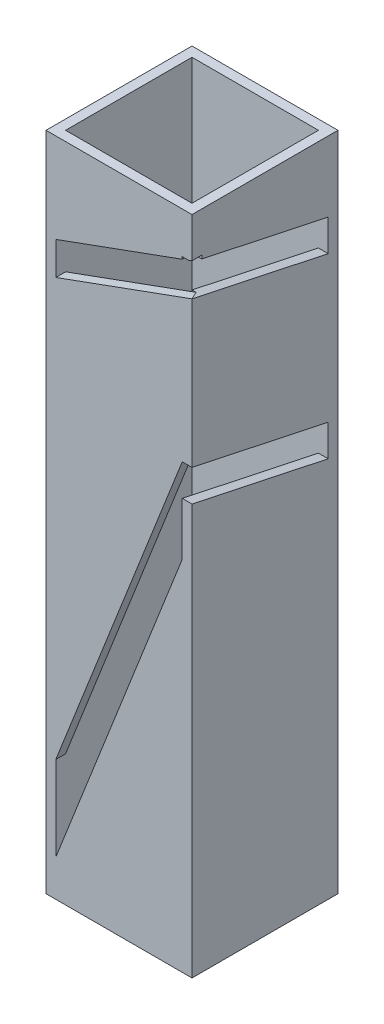
ISO-10303-21;
HEADER;
FILE_DESCRIPTION(('STEP AP214'),'2;1');
FILE_NAME('part.step','',(''),(''),'','','');
FILE_SCHEMA(('AUTOMOTIVE_DESIGN { 1 0 10303 214 1 1 1 1 }'));
ENDSEC;
DATA;
#1=APPLICATION_CONTEXT('core data for automotive mechanical design processes');
#2=APPLICATION_PROTOCOL_DEFINITION('international standard','automotive_design',2000,#1);
#3=PRODUCT_CONTEXT('',#1,'mechanical');
#4=PRODUCT('Part','Part','',(#3));
#5=PRODUCT_RELATED_PRODUCT_CATEGORY('part','',(#4));
#6=PRODUCT_DEFINITION_FORMATION('','',#4);
#7=PRODUCT_DEFINITION_CONTEXT('part definition',#1,'design');
#8=PRODUCT_DEFINITION('design','',#6,#7);
#9=PRODUCT_DEFINITION_SHAPE('','',#8);
#10=(LENGTH_UNIT() NAMED_UNIT(*) SI_UNIT(.MILLI.,.METRE.));
#11=(NAMED_UNIT(*) PLANE_ANGLE_UNIT() SI_UNIT($,.RADIAN.));
#12=(NAMED_UNIT(*) SI_UNIT($,.STERADIAN.) SOLID_ANGLE_UNIT());
#13=UNCERTAINTY_MEASURE_WITH_UNIT(LENGTH_MEASURE(1.E-05),#10,'distance_accuracy_value','');
#14=(GEOMETRIC_REPRESENTATION_CONTEXT(3) GLOBAL_UNCERTAINTY_ASSIGNED_CONTEXT((#13)) GLOBAL_UNIT_ASSIGNED_CONTEXT((#10,
#11,#12)) REPRESENTATION_CONTEXT('',''));
#15=CARTESIAN_POINT('',(0.,0.,0.));
#16=DIRECTION('',(0.,0.,1.));
#17=DIRECTION('',(1.,0.,0.));
#18=AXIS2_PLACEMENT_3D('',#15,#16,#17);
#19=CARTESIAN_POINT('',(19.431,203.2,19.431));
#20=DIRECTION('',(0.,0.,-1.));
#21=DIRECTION('',(-1.,0.,0.));
#22=AXIS2_PLACEMENT_3D('',#19,#20,#21);
#23=PLANE('',#22);
#24=DIRECTION('',(-0.939692620785909,-0.342020143325666,0.));
#25=VECTOR('',#24,1.);
#26=CARTESIAN_POINT('',(-19.431,175.661977169892,19.431));
#27=LINE('',#26,#25);
#28=CARTESIAN_POINT('',(19.431,189.806588413945,19.431));
#29=VERTEX_POINT('',#28);
#30=CARTESIAN_POINT('',(-19.431,175.661977169892,19.431));
#31=VERTEX_POINT('',#30);
#32=EDGE_CURVE('E208',#29,#31,#27,.T.);
#33=ORIENTED_EDGE('',*,*,#32,.T.);
#34=DIRECTION('',(0.,-1.,0.));
#35=VECTOR('',#34,1.);
#36=CARTESIAN_POINT('',(-19.431,203.2,19.431));
#37=LINE('',#36,#35);
#38=CARTESIAN_POINT('',(-19.431,203.2,19.431));
#39=VERTEX_POINT('',#38);
#40=EDGE_CURVE('E222',#39,#31,#37,.T.);
#41=ORIENTED_EDGE('',*,*,#40,.F.);
#42=DIRECTION('',(1.,0.,0.));
#43=VECTOR('',#42,1.);
#44=CARTESIAN_POINT('',(19.431,203.2,19.431));
#45=LINE('',#44,#43);
#46=CARTESIAN_POINT('',(19.431,203.2,19.431));
#47=VERTEX_POINT('',#46);
#48=EDGE_CURVE('E287',#39,#47,#45,.T.);
#49=ORIENTED_EDGE('',*,*,#48,.T.);
#50=DIRECTION('',(0.,-1.,0.));
#51=VECTOR('',#50,1.);
#52=CARTESIAN_POINT('',(19.431,203.2,19.431));
#53=LINE('',#52,#51);
#54=CARTESIAN_POINT('',(19.431,189.86233031499,19.431));
#55=VERTEX_POINT('',#54);
#56=EDGE_CURVE('E242',#47,#55,#53,.T.);
#57=ORIENTED_EDGE('',*,*,#56,.T.);
#58=DIRECTION('',(0.,1.,0.));
#59=VECTOR('',#58,1.);
#60=CARTESIAN_POINT('',(19.431,203.2,19.431));
#61=LINE('',#60,#59);
#62=EDGE_CURVE('E225',#29,#55,#61,.T.);
#63=ORIENTED_EDGE('',*,*,#62,.F.);
#64=EDGE_LOOP('',(#33,#41,#49,#57,#63));
#65=FACE_BOUND('',#64,.T.);
#66=ADVANCED_FACE('F33',(#65),#23,.T.);
#67=DIRECTION('',(0.366501226724284,0.93041756798203,0.));
#68=VECTOR('',#67,1.);
#69=CARTESIAN_POINT('',(19.431,109.909043825111,19.431));
#70=LINE('',#69,#68);
#71=CARTESIAN_POINT('',(-19.431,11.2521093038011,19.431));
#72=VERTEX_POINT('',#71);
#73=CARTESIAN_POINT('',(19.431,109.909043825111,19.431));
#74=VERTEX_POINT('',#73);
#75=EDGE_CURVE('E346',#72,#74,#70,.T.);
#76=ORIENTED_EDGE('',*,*,#75,.T.);
#77=CARTESIAN_POINT('',(19.431,0.,19.431));
#78=VERTEX_POINT('',#77);
#79=EDGE_CURVE('E247',#74,#78,#53,.T.);
#80=ORIENTED_EDGE('',*,*,#79,.T.);
#81=DIRECTION('',(1.,0.,0.));
#82=VECTOR('',#81,1.);
#83=CARTESIAN_POINT('',(19.431,0.,19.431));
#84=LINE('',#83,#82);
#85=CARTESIAN_POINT('',(-19.431,0.,19.431));
#86=VERTEX_POINT('',#85);
#87=EDGE_CURVE('E280',#86,#78,#84,.T.);
#88=ORIENTED_EDGE('',*,*,#87,.F.);
#89=EDGE_CURVE('E235',#72,#86,#37,.T.);
#90=ORIENTED_EDGE('',*,*,#89,.F.);
#91=EDGE_LOOP('',(#76,#80,#88,#90));
#92=FACE_BOUND('',#91,.T.);
#93=ADVANCED_FACE('F467',(#92),#23,.T.);
#94=CARTESIAN_POINT('',(19.431,203.2,19.431));
#95=DIRECTION('',(-1.,0.,0.));
#96=DIRECTION('',(0.,0.,1.));
#97=AXIS2_PLACEMENT_3D('',#94,#95,#96);
#98=PLANE('',#97);
#99=DIRECTION('',(0.,-0.207911690817749,-0.978147600733808));
#100=VECTOR('',#99,1.);
#101=CARTESIAN_POINT('',(19.431,171.864163049281,-19.431));
#102=LINE('',#101,#100);
#103=CARTESIAN_POINT('',(19.431,180.124536148901,19.431));
#104=VERTEX_POINT('',#103);
#105=CARTESIAN_POINT('',(19.431,171.864163049281,-19.431));
#106=VERTEX_POINT('',#105);
#107=EDGE_CURVE('E318',#104,#106,#102,.T.);
#108=ORIENTED_EDGE('',*,*,#107,.T.);
#109=DIRECTION('',(0.,-1.,0.));
#110=VECTOR('',#109,1.);
#111=CARTESIAN_POINT('',(19.431,203.2,-19.431));
#112=LINE('',#111,#110);
#113=CARTESIAN_POINT('',(19.431,127.,-19.431));
#114=VERTEX_POINT('',#113);
#115=EDGE_CURVE('E258',#106,#114,#112,.T.);
#116=ORIENTED_EDGE('',*,*,#115,.T.);
#117=DIRECTION('',(0.,0.207911690817763,0.978147600733805));
#118=VECTOR('',#117,1.);
#119=CARTESIAN_POINT('',(19.431,127.,-19.431));
#120=LINE('',#119,#118);
#121=CARTESIAN_POINT('',(19.431,135.898042784631,22.431));
#122=VERTEX_POINT('',#121);
#123=EDGE_CURVE('E302',#114,#122,#120,.T.);
#124=ORIENTED_EDGE('',*,*,#123,.T.);
#125=DIRECTION('',(0.,0.,1.));
#126=VECTOR('',#125,1.);
#127=CARTESIAN_POINT('',(19.431,135.898042784631,-111.132638802338));
#128=LINE('',#127,#126);
#129=CARTESIAN_POINT('',(19.431,135.898042784631,19.431));
#130=VERTEX_POINT('',#129);
#131=EDGE_CURVE('E350',#130,#122,#128,.T.);
#132=ORIENTED_EDGE('',*,*,#131,.F.);
#133=CARTESIAN_POINT('',(19.431,179.670295131112,19.431));
#134=VERTEX_POINT('',#133);
#135=EDGE_CURVE('E249',#134,#130,#53,.T.);
#136=ORIENTED_EDGE('',*,*,#135,.F.);
#137=EDGE_CURVE('E246',#104,#134,#53,.T.);
#138=ORIENTED_EDGE('',*,*,#137,.F.);
#139=EDGE_LOOP('',(#108,#116,#124,#132,#136,#138));
#140=FACE_BOUND('',#139,.T.);
#141=ADVANCED_FACE('F448',(#140),#98,.T.);
#142=DIRECTION('',(0.,-0.207911690817763,-0.978147600733805));
#143=VECTOR('',#142,1.);
#144=CARTESIAN_POINT('',(19.431,126.160248618541,22.431));
#145=LINE('',#144,#143);
#146=CARTESIAN_POINT('',(19.431,126.160248618541,22.431));
#147=VERTEX_POINT('',#146);
#148=CARTESIAN_POINT('',(19.431,117.262205833911,-19.431));
#149=VERTEX_POINT('',#148);
#150=EDGE_CURVE('E299',#147,#149,#145,.T.);
#151=ORIENTED_EDGE('',*,*,#150,.T.);
#152=CARTESIAN_POINT('',(19.431,0.,-19.431));
#153=VERTEX_POINT('',#152);
#154=EDGE_CURVE('E259',#149,#153,#112,.T.);
#155=ORIENTED_EDGE('',*,*,#154,.T.);
#156=DIRECTION('',(0.,0.,-1.));
#157=VECTOR('',#156,1.);
#158=CARTESIAN_POINT('',(19.431,0.,19.431));
#159=LINE('',#158,#157);
#160=EDGE_CURVE('E277',#78,#153,#159,.T.);
#161=ORIENTED_EDGE('',*,*,#160,.F.);
#162=ORIENTED_EDGE('',*,*,#79,.F.);
#163=DIRECTION('',(0.,0.,1.));
#164=VECTOR('',#163,1.);
#165=CARTESIAN_POINT('',(19.431,109.909043825111,-111.132638802338));
#166=LINE('',#165,#164);
#167=CARTESIAN_POINT('',(19.431,109.909043825111,22.431));
#168=VERTEX_POINT('',#167);
#169=EDGE_CURVE('E348',#74,#168,#166,.T.);
#170=ORIENTED_EDGE('',*,*,#169,.T.);
#171=DIRECTION('',(0.,1.,0.));
#172=VECTOR('',#171,1.);
#173=CARTESIAN_POINT('',(19.431,135.898042784631,22.431));
#174=LINE('',#173,#172);
#175=EDGE_CURVE('E347',#168,#147,#174,.T.);
#176=ORIENTED_EDGE('',*,*,#175,.T.);
#177=EDGE_LOOP('',(#151,#155,#161,#162,#170,#176));
#178=FACE_BOUND('',#177,.T.);
#179=ADVANCED_FACE('F479',(#178),#98,.T.);
#180=CARTESIAN_POINT('',(0.,203.2,0.));
#181=DIRECTION('',(0.,-1.,0.));
#182=DIRECTION('',(0.,0.,-1.));
#183=AXIS2_PLACEMENT_3D('',#180,#181,#182);
#184=PLANE('',#183);
#185=DIRECTION('',(0.,0.,1.));
#186=VECTOR('',#185,1.);
#187=CARTESIAN_POINT('',(-22.431,203.2,-22.431));
#188=LINE('',#187,#186);
#189=CARTESIAN_POINT('',(-22.431,203.2,-22.431));
#190=VERTEX_POINT('',#189);
#191=CARTESIAN_POINT('',(-22.431,203.2,22.431));
#192=VERTEX_POINT('',#191);
#193=EDGE_CURVE('E516',#190,#192,#188,.T.);
#194=ORIENTED_EDGE('',*,*,#193,.T.);
#195=DIRECTION('',(1.,0.,0.));
#196=VECTOR('',#195,1.);
#197=CARTESIAN_POINT('',(22.431,203.2,22.431));
#198=LINE('',#197,#196);
#199=CARTESIAN_POINT('',(22.431,203.2,22.431));
#200=VERTEX_POINT('',#199);
#201=EDGE_CURVE('E513',#192,#200,#198,.T.);
#202=ORIENTED_EDGE('',*,*,#201,.T.);
#203=DIRECTION('',(0.,0.,-1.));
#204=VECTOR('',#203,1.);
#205=CARTESIAN_POINT('',(22.431,203.2,-22.431));
#206=LINE('',#205,#204);
#207=CARTESIAN_POINT('',(22.431,203.2,-22.431));
#208=VERTEX_POINT('',#207);
#209=EDGE_CURVE('E515',#200,#208,#206,.T.);
#210=ORIENTED_EDGE('',*,*,#209,.T.);
#211=DIRECTION('',(-1.,0.,0.));
#212=VECTOR('',#211,1.);
#213=CARTESIAN_POINT('',(22.431,203.2,-22.431));
#214=LINE('',#213,#212);
#215=EDGE_CURVE('E519',#208,#190,#214,.T.);
#216=ORIENTED_EDGE('',*,*,#215,.T.);
#217=EDGE_LOOP('',(#194,#202,#210,#216));
#218=FACE_BOUND('',#217,.T.);
#219=DIRECTION('',(0.,0.,1.));
#220=VECTOR('',#219,1.);
#221=CARTESIAN_POINT('',(-19.431,203.2,19.431));
#222=LINE('',#221,#220);
#223=CARTESIAN_POINT('',(-19.431,203.2,-19.431));
#224=VERTEX_POINT('',#223);
#225=EDGE_CURVE('E231',#224,#39,#222,.T.);
#226=ORIENTED_EDGE('',*,*,#225,.F.);
#227=DIRECTION('',(-1.,0.,0.));
#228=VECTOR('',#227,1.);
#229=CARTESIAN_POINT('',(19.431,203.2,-19.431));
#230=LINE('',#229,#228);
#231=CARTESIAN_POINT('',(19.431,203.2,-19.431));
#232=VERTEX_POINT('',#231);
#233=EDGE_CURVE('E270',#232,#224,#230,.T.);
#234=ORIENTED_EDGE('',*,*,#233,.F.);
#235=DIRECTION('',(0.,0.,-1.));
#236=VECTOR('',#235,1.);
#237=CARTESIAN_POINT('',(19.431,203.2,19.431));
#238=LINE('',#237,#236);
#239=EDGE_CURVE('E272',#47,#232,#238,.T.);
#240=ORIENTED_EDGE('',*,*,#239,.F.);
#241=ORIENTED_EDGE('',*,*,#48,.F.);
#242=EDGE_LOOP('',(#226,#234,#240,#241));
#243=FACE_BOUND('',#242,.T.);
#244=ADVANCED_FACE('F431',(#218,#243),#184,.F.);
#245=CARTESIAN_POINT('',(0.,0.,0.));
#246=DIRECTION('',(0.,-1.,0.));
#247=DIRECTION('',(0.,0.,-1.));
#248=AXIS2_PLACEMENT_3D('',#245,#246,#247);
#249=PLANE('',#248);
#250=DIRECTION('',(0.,0.,1.));
#251=VECTOR('',#250,1.);
#252=CARTESIAN_POINT('',(-22.431,0.,-22.431));
#253=LINE('',#252,#251);
#254=CARTESIAN_POINT('',(-22.431,0.,-22.431));
#255=VERTEX_POINT('',#254);
#256=CARTESIAN_POINT('',(-22.431,0.,22.431));
#257=VERTEX_POINT('',#256);
#258=EDGE_CURVE('E232',#255,#257,#253,.T.);
#259=ORIENTED_EDGE('',*,*,#258,.F.);
#260=DIRECTION('',(-1.,0.,0.));
#261=VECTOR('',#260,1.);
#262=CARTESIAN_POINT('',(22.431,0.,-22.431));
#263=LINE('',#262,#261);
#264=CARTESIAN_POINT('',(22.431,0.,-22.431));
#265=VERTEX_POINT('',#264);
#266=EDGE_CURVE('E509',#265,#255,#263,.T.);
#267=ORIENTED_EDGE('',*,*,#266,.F.);
#268=DIRECTION('',(0.,0.,-1.));
#269=VECTOR('',#268,1.);
#270=CARTESIAN_POINT('',(22.431,0.,-22.431));
#271=LINE('',#270,#269);
#272=CARTESIAN_POINT('',(22.431,0.,22.431));
#273=VERTEX_POINT('',#272);
#274=EDGE_CURVE('E511',#273,#265,#271,.T.);
#275=ORIENTED_EDGE('',*,*,#274,.F.);
#276=DIRECTION('',(1.,0.,0.));
#277=VECTOR('',#276,1.);
#278=CARTESIAN_POINT('',(22.431,0.,22.431));
#279=LINE('',#278,#277);
#280=EDGE_CURVE('E237',#257,#273,#279,.T.);
#281=ORIENTED_EDGE('',*,*,#280,.F.);
#282=EDGE_LOOP('',(#259,#267,#275,#281));
#283=FACE_BOUND('',#282,.T.);
#284=DIRECTION('',(-1.,0.,0.));
#285=VECTOR('',#284,1.);
#286=CARTESIAN_POINT('',(19.431,0.,-19.431));
#287=LINE('',#286,#285);
#288=CARTESIAN_POINT('',(-19.431,0.,-19.431));
#289=VERTEX_POINT('',#288);
#290=EDGE_CURVE('E275',#153,#289,#287,.T.);
#291=ORIENTED_EDGE('',*,*,#290,.T.);
#292=DIRECTION('',(0.,0.,1.));
#293=VECTOR('',#292,1.);
#294=CARTESIAN_POINT('',(-19.431,0.,19.431));
#295=LINE('',#294,#293);
#296=EDGE_CURVE('E283',#289,#86,#295,.T.);
#297=ORIENTED_EDGE('',*,*,#296,.T.);
#298=ORIENTED_EDGE('',*,*,#87,.T.);
#299=ORIENTED_EDGE('',*,*,#160,.T.);
#300=EDGE_LOOP('',(#291,#297,#298,#299));
#301=FACE_BOUND('',#300,.T.);
#302=ADVANCED_FACE('F434',(#283,#301),#249,.T.);
#303=CARTESIAN_POINT('',(-22.431,203.2,-22.431));
#304=DIRECTION('',(1.,0.,0.));
#305=DIRECTION('',(0.,0.,-1.));
#306=AXIS2_PLACEMENT_3D('',#303,#304,#305);
#307=PLANE('',#306);
#308=ORIENTED_EDGE('',*,*,#258,.T.);
#309=DIRECTION('',(0.,-1.,0.));
#310=VECTOR('',#309,1.);
#311=CARTESIAN_POINT('',(-22.431,203.2,22.431));
#312=LINE('',#311,#310);
#313=EDGE_CURVE('E404',#192,#257,#312,.T.);
#314=ORIENTED_EDGE('',*,*,#313,.F.);
#315=ORIENTED_EDGE('',*,*,#193,.F.);
#316=DIRECTION('',(0.,-1.,0.));
#317=VECTOR('',#316,1.);
#318=CARTESIAN_POINT('',(-22.431,203.2,-22.431));
#319=LINE('',#318,#317);
#320=EDGE_CURVE('E506',#190,#255,#319,.T.);
#321=ORIENTED_EDGE('',*,*,#320,.T.);
#322=EDGE_LOOP('',(#308,#314,#315,#321));
#323=FACE_BOUND('',#322,.T.);
#324=ADVANCED_FACE('F35',(#323),#307,.F.);
#325=CARTESIAN_POINT('',(22.431,203.2,22.431));
#326=DIRECTION('',(0.,0.,-1.));
#327=DIRECTION('',(-1.,0.,0.));
#328=AXIS2_PLACEMENT_3D('',#325,#326,#327);
#329=PLANE('',#328);
#330=DIRECTION('',(1.,0.,0.));
#331=VECTOR('',#330,1.);
#332=CARTESIAN_POINT('',(-26.3917177593584,190.5,22.431));
#333=LINE('',#332,#331);
#334=CARTESIAN_POINT('',(19.431,190.5,22.431));
#335=VERTEX_POINT('',#334);
#336=CARTESIAN_POINT('',(21.336132675074,190.5,22.431));
#337=VERTEX_POINT('',#336);
#338=EDGE_CURVE('E321',#335,#337,#333,.T.);
#339=ORIENTED_EDGE('',*,*,#338,.T.);
#340=DIRECTION('',(-0.939692620785909,-0.342020143325666,0.));
#341=VECTOR('',#340,1.);
#342=CARTESIAN_POINT('',(-19.431,175.661977169892,22.431));
#343=LINE('',#342,#341);
#344=CARTESIAN_POINT('',(22.431,190.898499116744,22.431));
#345=VERTEX_POINT('',#344);
#346=EDGE_CURVE('E48',#345,#337,#343,.T.);
#347=ORIENTED_EDGE('',*,*,#346,.F.);
#348=DIRECTION('',(0.,-1.,0.));
#349=VECTOR('',#348,1.);
#350=CARTESIAN_POINT('',(22.431,203.2,22.431));
#351=LINE('',#350,#349);
#352=EDGE_CURVE('E400',#200,#345,#351,.T.);
#353=ORIENTED_EDGE('',*,*,#352,.F.);
#354=ORIENTED_EDGE('',*,*,#201,.F.);
#355=ORIENTED_EDGE('',*,*,#313,.T.);
#356=ORIENTED_EDGE('',*,*,#280,.T.);
#357=CARTESIAN_POINT('',(22.431,126.160248618541,22.431));
#358=VERTEX_POINT('',#357);
#359=EDGE_CURVE('E401',#358,#273,#351,.T.);
#360=ORIENTED_EDGE('',*,*,#359,.F.);
#361=DIRECTION('',(1.,0.,0.));
#362=VECTOR('',#361,1.);
#363=CARTESIAN_POINT('',(-26.3917177593584,126.160248618541,22.431));
#364=LINE('',#363,#362);
#365=EDGE_CURVE('E292',#147,#358,#364,.T.);
#366=ORIENTED_EDGE('',*,*,#365,.F.);
#367=ORIENTED_EDGE('',*,*,#175,.F.);
#368=DIRECTION('',(0.366501226724284,0.93041756798203,0.));
#369=VECTOR('',#368,1.);
#370=CARTESIAN_POINT('',(19.431,109.909043825111,22.431));
#371=LINE('',#370,#369);
#372=CARTESIAN_POINT('',(-19.431,11.2521093038011,22.431));
#373=VERTEX_POINT('',#372);
#374=EDGE_CURVE('E362',#373,#168,#371,.T.);
#375=ORIENTED_EDGE('',*,*,#374,.F.);
#376=DIRECTION('',(0.,-1.,0.));
#377=VECTOR('',#376,1.);
#378=CARTESIAN_POINT('',(-19.431,11.2521093038011,22.431));
#379=LINE('',#378,#377);
#380=CARTESIAN_POINT('',(-19.431,37.2411082633204,22.431));
#381=VERTEX_POINT('',#380);
#382=EDGE_CURVE('E359',#381,#373,#379,.T.);
#383=ORIENTED_EDGE('',*,*,#382,.F.);
#384=DIRECTION('',(-0.366501226724285,-0.930417567982029,0.));
#385=VECTOR('',#384,1.);
#386=CARTESIAN_POINT('',(-19.431,37.2411082633204,22.431));
#387=LINE('',#386,#385);
#388=EDGE_CURVE('E356',#122,#381,#387,.T.);
#389=ORIENTED_EDGE('',*,*,#388,.F.);
#390=DIRECTION('',(1.,0.,0.));
#391=VECTOR('',#390,1.);
#392=CARTESIAN_POINT('',(-26.3917177593584,135.898042784631,22.431));
#393=LINE('',#392,#391);
#394=CARTESIAN_POINT('',(22.431,135.898042784631,22.431));
#395=VERTEX_POINT('',#394);
#396=EDGE_CURVE('E295',#122,#395,#393,.T.);
#397=ORIENTED_EDGE('',*,*,#396,.T.);
#398=CARTESIAN_POINT('',(22.431,180.762205833911,22.431));
#399=VERTEX_POINT('',#398);
#400=EDGE_CURVE('E395',#399,#395,#351,.T.);
#401=ORIENTED_EDGE('',*,*,#400,.F.);
#402=DIRECTION('',(0.939692620785909,0.342020143325667,0.));
#403=VECTOR('',#402,1.);
#404=CARTESIAN_POINT('',(22.431,180.762205833911,22.431));
#405=LINE('',#404,#403);
#406=CARTESIAN_POINT('',(-19.431,165.525683887059,22.431));
#407=VERTEX_POINT('',#406);
#408=EDGE_CURVE('E226',#407,#399,#405,.T.);
#409=ORIENTED_EDGE('',*,*,#408,.F.);
#410=DIRECTION('',(0.,-1.,0.));
#411=VECTOR('',#410,1.);
#412=CARTESIAN_POINT('',(-19.431,165.525683887059,22.431));
#413=LINE('',#412,#411);
#414=CARTESIAN_POINT('',(-19.431,175.661977169892,22.431));
#415=VERTEX_POINT('',#414);
#416=EDGE_CURVE('E376',#415,#407,#413,.T.);
#417=ORIENTED_EDGE('',*,*,#416,.F.);
#418=CARTESIAN_POINT('',(19.431,189.806588413945,22.431));
#419=VERTEX_POINT('',#418);
#420=EDGE_CURVE('E211',#419,#415,#343,.T.);
#421=ORIENTED_EDGE('',*,*,#420,.F.);
#422=DIRECTION('',(0.,-1.,0.));
#423=VECTOR('',#422,1.);
#424=CARTESIAN_POINT('',(19.431,190.5,22.431));
#425=LINE('',#424,#423);
#426=EDGE_CURVE('E291',#335,#419,#425,.T.);
#427=ORIENTED_EDGE('',*,*,#426,.F.);
#428=EDGE_LOOP('',(#339,#347,#353,#354,#355,#356,#360,#366,#367,#375,#383,#389,#397,#401,#409,
#417,#421,#427));
#429=FACE_BOUND('',#428,.T.);
#430=ADVANCED_FACE('F397',(#429),#329,.F.);
#431=CARTESIAN_POINT('',(22.431,203.2,-22.431));
#432=DIRECTION('',(-1.,0.,0.));
#433=DIRECTION('',(0.,0.,1.));
#434=AXIS2_PLACEMENT_3D('',#431,#432,#433);
#435=PLANE('',#434);
#436=DIRECTION('',(0.,0.,1.));
#437=VECTOR('',#436,1.);
#438=CARTESIAN_POINT('',(22.431,190.898499116744,-111.132638802338));
#439=LINE('',#438,#437);
#440=CARTESIAN_POINT('',(22.431,190.898499116744,19.431));
#441=VERTEX_POINT('',#440);
#442=EDGE_CURVE('E340',#441,#345,#439,.T.);
#443=ORIENTED_EDGE('',*,*,#442,.F.);
#444=DIRECTION('',(0.,1.,0.));
#445=VECTOR('',#444,1.);
#446=CARTESIAN_POINT('',(22.431,190.898499116744,19.431));
#447=LINE('',#446,#445);
#448=CARTESIAN_POINT('',(22.431,189.86233031499,19.431));
#449=VERTEX_POINT('',#448);
#450=EDGE_CURVE('E366',#449,#441,#447,.T.);
#451=ORIENTED_EDGE('',*,*,#450,.F.);
#452=DIRECTION('',(0.,0.207911690817749,0.978147600733808));
#453=VECTOR('',#452,1.);
#454=CARTESIAN_POINT('',(22.431,190.5,22.431));
#455=LINE('',#454,#453);
#456=CARTESIAN_POINT('',(22.431,181.60195721537,-19.431));
#457=VERTEX_POINT('',#456);
#458=EDGE_CURVE('E330',#457,#449,#455,.T.);
#459=ORIENTED_EDGE('',*,*,#458,.F.);
#460=DIRECTION('',(0.,1.,0.));
#461=VECTOR('',#460,1.);
#462=CARTESIAN_POINT('',(22.431,181.60195721537,-19.431));
#463=LINE('',#462,#461);
#464=CARTESIAN_POINT('',(22.431,171.864163049281,-19.431));
#465=VERTEX_POINT('',#464);
#466=EDGE_CURVE('E56',#465,#457,#463,.T.);
#467=ORIENTED_EDGE('',*,*,#466,.F.);
#468=DIRECTION('',(0.,-0.207911690817749,-0.978147600733808));
#469=VECTOR('',#468,1.);
#470=CARTESIAN_POINT('',(22.431,171.864163049281,-19.431));
#471=LINE('',#470,#469);
#472=EDGE_CURVE('E294',#399,#465,#471,.T.);
#473=ORIENTED_EDGE('',*,*,#472,.F.);
#474=ORIENTED_EDGE('',*,*,#400,.T.);
#475=DIRECTION('',(0.,0.207911690817763,0.978147600733805));
#476=VECTOR('',#475,1.);
#477=CARTESIAN_POINT('',(22.431,127.,-19.431));
#478=LINE('',#477,#476);
#479=CARTESIAN_POINT('',(22.431,127.,-19.431));
#480=VERTEX_POINT('',#479);
#481=EDGE_CURVE('E307',#480,#395,#478,.T.);
#482=ORIENTED_EDGE('',*,*,#481,.F.);
#483=DIRECTION('',(0.,1.,0.));
#484=VECTOR('',#483,1.);
#485=CARTESIAN_POINT('',(22.431,117.262205833911,-19.431));
#486=LINE('',#485,#484);
#487=CARTESIAN_POINT('',(22.431,117.262205833911,-19.431));
#488=VERTEX_POINT('',#487);
#489=EDGE_CURVE('E311',#488,#480,#486,.T.);
#490=ORIENTED_EDGE('',*,*,#489,.F.);
#491=DIRECTION('',(0.,-0.207911690817763,-0.978147600733805));
#492=VECTOR('',#491,1.);
#493=CARTESIAN_POINT('',(22.431,126.160248618541,22.431));
#494=LINE('',#493,#492);
#495=EDGE_CURVE('E308',#358,#488,#494,.T.);
#496=ORIENTED_EDGE('',*,*,#495,.F.);
#497=ORIENTED_EDGE('',*,*,#359,.T.);
#498=ORIENTED_EDGE('',*,*,#274,.T.);
#499=DIRECTION('',(0.,-1.,0.));
#500=VECTOR('',#499,1.);
#501=CARTESIAN_POINT('',(22.431,203.2,-22.431));
#502=LINE('',#501,#500);
#503=EDGE_CURVE('E405',#208,#265,#502,.T.);
#504=ORIENTED_EDGE('',*,*,#503,.F.);
#505=ORIENTED_EDGE('',*,*,#209,.F.);
#506=ORIENTED_EDGE('',*,*,#352,.T.);
#507=EDGE_LOOP('',(#443,#451,#459,#467,#473,#474,#482,#490,#496,#497,#498,#504,#505,#506));
#508=FACE_BOUND('',#507,.T.);
#509=ADVANCED_FACE('F393',(#508),#435,.F.);
#510=CARTESIAN_POINT('',(22.431,203.2,-22.431));
#511=DIRECTION('',(0.,0.,1.));
#512=DIRECTION('',(1.,0.,0.));
#513=AXIS2_PLACEMENT_3D('',#510,#511,#512);
#514=PLANE('',#513);
#515=ORIENTED_EDGE('',*,*,#266,.T.);
#516=ORIENTED_EDGE('',*,*,#320,.F.);
#517=ORIENTED_EDGE('',*,*,#215,.F.);
#518=ORIENTED_EDGE('',*,*,#503,.T.);
#519=EDGE_LOOP('',(#515,#516,#517,#518));
#520=FACE_BOUND('',#519,.T.);
#521=ADVANCED_FACE('F480',(#520),#514,.F.);
#522=CARTESIAN_POINT('',(-19.431,203.2,19.431));
#523=DIRECTION('',(1.,0.,0.));
#524=DIRECTION('',(0.,0.,-1.));
#525=AXIS2_PLACEMENT_3D('',#522,#523,#524);
#526=PLANE('',#525);
#527=ORIENTED_EDGE('',*,*,#296,.F.);
#528=DIRECTION('',(0.,-1.,0.));
#529=VECTOR('',#528,1.);
#530=CARTESIAN_POINT('',(-19.431,203.2,-19.431));
#531=LINE('',#530,#529);
#532=EDGE_CURVE('E265',#224,#289,#531,.T.);
#533=ORIENTED_EDGE('',*,*,#532,.F.);
#534=ORIENTED_EDGE('',*,*,#225,.T.);
#535=ORIENTED_EDGE('',*,*,#40,.T.);
#536=DIRECTION('',(0.,0.,1.));
#537=VECTOR('',#536,1.);
#538=CARTESIAN_POINT('',(-19.431,175.661977169892,-111.132638802338));
#539=LINE('',#538,#537);
#540=EDGE_CURVE('E205',#31,#415,#539,.T.);
#541=ORIENTED_EDGE('',*,*,#540,.T.);
#542=ORIENTED_EDGE('',*,*,#416,.T.);
#543=DIRECTION('',(0.,0.,1.));
#544=VECTOR('',#543,1.);
#545=CARTESIAN_POINT('',(-19.431,165.525683887059,-111.132638802338));
#546=LINE('',#545,#544);
#547=CARTESIAN_POINT('',(-19.431,165.525683887059,19.431));
#548=VERTEX_POINT('',#547);
#549=EDGE_CURVE('E216',#548,#407,#546,.T.);
#550=ORIENTED_EDGE('',*,*,#549,.F.);
#551=CARTESIAN_POINT('',(-19.431,37.2411082633204,19.431));
#552=VERTEX_POINT('',#551);
#553=EDGE_CURVE('E233',#548,#552,#37,.T.);
#554=ORIENTED_EDGE('',*,*,#553,.T.);
#555=DIRECTION('',(0.,0.,1.));
#556=VECTOR('',#555,1.);
#557=CARTESIAN_POINT('',(-19.431,37.2411082633204,-111.132638802338));
#558=LINE('',#557,#556);
#559=EDGE_CURVE('E341',#552,#381,#558,.T.);
#560=ORIENTED_EDGE('',*,*,#559,.T.);
#561=ORIENTED_EDGE('',*,*,#382,.T.);
#562=DIRECTION('',(0.,0.,1.));
#563=VECTOR('',#562,1.);
#564=CARTESIAN_POINT('',(-19.431,11.2521093038011,-111.132638802338));
#565=LINE('',#564,#563);
#566=EDGE_CURVE('E344',#72,#373,#565,.T.);
#567=ORIENTED_EDGE('',*,*,#566,.F.);
#568=ORIENTED_EDGE('',*,*,#89,.T.);
#569=EDGE_LOOP('',(#527,#533,#534,#535,#541,#542,#550,#554,#560,#561,#567,#568));
#570=FACE_BOUND('',#569,.T.);
#571=ADVANCED_FACE('F228',(#570),#526,.T.);
#572=DIRECTION('',(0.939692620785909,0.342020143325667,0.));
#573=VECTOR('',#572,1.);
#574=CARTESIAN_POINT('',(22.431,180.762205833911,19.431));
#575=LINE('',#574,#573);
#576=EDGE_CURVE('E370',#548,#134,#575,.T.);
#577=ORIENTED_EDGE('',*,*,#576,.T.);
#578=ORIENTED_EDGE('',*,*,#135,.T.);
#579=DIRECTION('',(-0.366501226724285,-0.93041756798203,0.));
#580=VECTOR('',#579,1.);
#581=CARTESIAN_POINT('',(-19.431,37.2411082633204,19.431));
#582=LINE('',#581,#580);
#583=EDGE_CURVE('E343',#130,#552,#582,.T.);
#584=ORIENTED_EDGE('',*,*,#583,.T.);
#585=ORIENTED_EDGE('',*,*,#553,.F.);
#586=EDGE_LOOP('',(#577,#578,#584,#585));
#587=FACE_BOUND('',#586,.T.);
#588=ADVANCED_FACE('F456',(#587),#23,.T.);
#589=DIRECTION('',(0.,0.207911690817749,0.978147600733808));
#590=VECTOR('',#589,1.);
#591=CARTESIAN_POINT('',(19.431,190.5,22.431));
#592=LINE('',#591,#590);
#593=CARTESIAN_POINT('',(19.431,181.60195721537,-19.431));
#594=VERTEX_POINT('',#593);
#595=EDGE_CURVE('E324',#594,#55,#592,.T.);
#596=ORIENTED_EDGE('',*,*,#595,.T.);
#597=ORIENTED_EDGE('',*,*,#56,.F.);
#598=ORIENTED_EDGE('',*,*,#239,.T.);
#599=EDGE_CURVE('E251',#232,#594,#112,.T.);
#600=ORIENTED_EDGE('',*,*,#599,.T.);
#601=EDGE_LOOP('',(#596,#597,#598,#600));
#602=FACE_BOUND('',#601,.T.);
#603=ADVANCED_FACE('F427',(#602),#98,.T.);
#604=CARTESIAN_POINT('',(19.431,203.2,-19.431));
#605=DIRECTION('',(0.,0.,1.));
#606=DIRECTION('',(1.,0.,0.));
#607=AXIS2_PLACEMENT_3D('',#604,#605,#606);
#608=PLANE('',#607);
#609=ORIENTED_EDGE('',*,*,#290,.F.);
#610=ORIENTED_EDGE('',*,*,#154,.F.);
#611=DIRECTION('',(1.,0.,0.));
#612=VECTOR('',#611,1.);
#613=CARTESIAN_POINT('',(-26.3917177593584,117.262205833911,-19.431));
#614=LINE('',#613,#612);
#615=EDGE_CURVE('E296',#149,#488,#614,.T.);
#616=ORIENTED_EDGE('',*,*,#615,.T.);
#617=ORIENTED_EDGE('',*,*,#489,.T.);
#618=DIRECTION('',(1.,0.,0.));
#619=VECTOR('',#618,1.);
#620=CARTESIAN_POINT('',(-26.3917177593584,127.,-19.431));
#621=LINE('',#620,#619);
#622=EDGE_CURVE('E298',#114,#480,#621,.T.);
#623=ORIENTED_EDGE('',*,*,#622,.F.);
#624=ORIENTED_EDGE('',*,*,#115,.F.);
#625=DIRECTION('',(1.,0.,0.));
#626=VECTOR('',#625,1.);
#627=CARTESIAN_POINT('',(-26.3917177593584,171.864163049281,-19.431));
#628=LINE('',#627,#626);
#629=EDGE_CURVE('E315',#106,#465,#628,.T.);
#630=ORIENTED_EDGE('',*,*,#629,.T.);
#631=ORIENTED_EDGE('',*,*,#466,.T.);
#632=DIRECTION('',(1.,0.,0.));
#633=VECTOR('',#632,1.);
#634=CARTESIAN_POINT('',(-26.3917177593584,181.60195721537,-19.431));
#635=LINE('',#634,#633);
#636=EDGE_CURVE('E317',#594,#457,#635,.T.);
#637=ORIENTED_EDGE('',*,*,#636,.F.);
#638=ORIENTED_EDGE('',*,*,#599,.F.);
#639=ORIENTED_EDGE('',*,*,#233,.T.);
#640=ORIENTED_EDGE('',*,*,#532,.T.);
#641=EDGE_LOOP('',(#609,#610,#616,#617,#623,#624,#630,#631,#637,#638,#639,#640));
#642=FACE_BOUND('',#641,.T.);
#643=ADVANCED_FACE('F432',(#642),#608,.T.);
#644=CARTESIAN_POINT('',(-26.3917177593584,126.160248618541,22.431));
#645=DIRECTION('',(0.,-0.978147600733805,0.207911690817763));
#646=DIRECTION('',(0.,-0.207911690817763,-0.978147600733805));
#647=AXIS2_PLACEMENT_3D('',#644,#645,#646);
#648=PLANE('',#647);
#649=ORIENTED_EDGE('',*,*,#365,.T.);
#650=ORIENTED_EDGE('',*,*,#495,.T.);
#651=ORIENTED_EDGE('',*,*,#615,.F.);
#652=ORIENTED_EDGE('',*,*,#150,.F.);
#653=EDGE_LOOP('',(#649,#650,#651,#652));
#654=FACE_BOUND('',#653,.T.);
#655=ADVANCED_FACE('F440',(#654),#648,.F.);
#656=CARTESIAN_POINT('',(-26.3917177593584,127.,-19.431));
#657=DIRECTION('',(0.,0.978147600733805,-0.207911690817763));
#658=DIRECTION('',(0.,0.207911690817763,0.978147600733805));
#659=AXIS2_PLACEMENT_3D('',#656,#657,#658);
#660=PLANE('',#659);
#661=ORIENTED_EDGE('',*,*,#622,.T.);
#662=ORIENTED_EDGE('',*,*,#481,.T.);
#663=ORIENTED_EDGE('',*,*,#396,.F.);
#664=ORIENTED_EDGE('',*,*,#123,.F.);
#665=EDGE_LOOP('',(#661,#662,#663,#664));
#666=FACE_BOUND('',#665,.T.);
#667=ADVANCED_FACE('F444',(#666),#660,.F.);
#668=CARTESIAN_POINT('',(19.431,203.2,19.431));
#669=DIRECTION('',(-1.,0.,0.));
#670=DIRECTION('',(0.,0.,1.));
#671=AXIS2_PLACEMENT_3D('',#668,#669,#670);
#672=PLANE('',#671);
#673=ORIENTED_EDGE('',*,*,#426,.T.);
#674=DIRECTION('',(0.,0.,-1.));
#675=VECTOR('',#674,1.);
#676=CARTESIAN_POINT('',(19.431,189.806588413945,19.431));
#677=LINE('',#676,#675);
#678=EDGE_CURVE('E338',#419,#29,#677,.T.);
#679=ORIENTED_EDGE('',*,*,#678,.T.);
#680=ORIENTED_EDGE('',*,*,#62,.T.);
#681=EDGE_CURVE('E320',#55,#335,#592,.T.);
#682=ORIENTED_EDGE('',*,*,#681,.T.);
#683=EDGE_LOOP('',(#673,#679,#680,#682));
#684=FACE_BOUND('',#683,.T.);
#685=ADVANCED_FACE('F457',(#684),#672,.F.);
#686=CARTESIAN_POINT('',(-26.3917177593584,171.864163049281,-19.431));
#687=DIRECTION('',(0.,-0.978147600733808,0.207911690817749));
#688=DIRECTION('',(0.,-0.207911690817749,-0.978147600733808));
#689=AXIS2_PLACEMENT_3D('',#686,#687,#688);
#690=PLANE('',#689);
#691=ORIENTED_EDGE('',*,*,#107,.F.);
#692=DIRECTION('',(1.,0.,0.));
#693=VECTOR('',#692,1.);
#694=CARTESIAN_POINT('',(-26.3917177593584,180.124536148901,19.431));
#695=LINE('',#694,#693);
#696=CARTESIAN_POINT('',(20.6790169393642,180.124536148901,19.431));
#697=VERTEX_POINT('',#696);
#698=EDGE_CURVE('E312',#104,#697,#695,.T.);
#699=ORIENTED_EDGE('',*,*,#698,.T.);
#700=DIRECTION('',(0.496010704151852,0.180533132188692,0.849341609453419));
#701=VECTOR('',#700,1.);
#702=CARTESIAN_POINT('',(-8.01320482012074,169.681421473483,-29.6999917387079));
#703=LINE('',#702,#701);
#704=EDGE_CURVE('E11',#697,#399,#703,.T.);
#705=ORIENTED_EDGE('',*,*,#704,.T.);
#706=ORIENTED_EDGE('',*,*,#472,.T.);
#707=ORIENTED_EDGE('',*,*,#629,.F.);
#708=EDGE_LOOP('',(#691,#699,#705,#706,#707));
#709=FACE_BOUND('',#708,.T.);
#710=ADVANCED_FACE('F389',(#709),#690,.F.);
#711=CARTESIAN_POINT('',(-26.3917177593584,190.5,22.431));
#712=DIRECTION('',(0.,0.978147600733808,-0.207911690817749));
#713=DIRECTION('',(0.,0.207911690817749,0.978147600733808));
#714=AXIS2_PLACEMENT_3D('',#711,#712,#713);
#715=PLANE('',#714);
#716=ORIENTED_EDGE('',*,*,#458,.T.);
#717=DIRECTION('',(-1.,0.,0.));
#718=VECTOR('',#717,1.);
#719=CARTESIAN_POINT('',(-26.3917177593584,189.86233031499,19.431));
#720=LINE('',#719,#718);
#721=CARTESIAN_POINT('',(19.5841496144382,189.86233031499,19.431));
#722=VERTEX_POINT('',#721);
#723=EDGE_CURVE('E41',#449,#722,#720,.T.);
#724=ORIENTED_EDGE('',*,*,#723,.T.);
#725=DIRECTION('',(0.496010704151852,0.180533132188692,0.849341609453419));
#726=VECTOR('',#725,1.);
#727=CARTESIAN_POINT('',(9.59381101805872,186.226144435667,2.32409042847627));
#728=LINE('',#727,#726);
#729=EDGE_CURVE('E411',#722,#337,#728,.T.);
#730=ORIENTED_EDGE('',*,*,#729,.T.);
#731=ORIENTED_EDGE('',*,*,#338,.F.);
#732=ORIENTED_EDGE('',*,*,#681,.F.);
#733=ORIENTED_EDGE('',*,*,#595,.F.);
#734=ORIENTED_EDGE('',*,*,#636,.T.);
#735=EDGE_LOOP('',(#716,#724,#730,#731,#732,#733,#734));
#736=FACE_BOUND('',#735,.T.);
#737=ADVANCED_FACE('F414',(#736),#715,.F.);
#738=CARTESIAN_POINT('',(-19.431,175.661977169892,-111.132638802338));
#739=DIRECTION('',(-0.342020143325666,0.939692620785909,0.));
#740=DIRECTION('',(-0.939692620785909,-0.342020143325666,0.));
#741=AXIS2_PLACEMENT_3D('',#738,#739,#740);
#742=PLANE('',#741);
#743=EDGE_CURVE('E217',#441,#722,#27,.T.);
#744=ORIENTED_EDGE('',*,*,#743,.F.);
#745=ORIENTED_EDGE('',*,*,#442,.T.);
#746=ORIENTED_EDGE('',*,*,#346,.T.);
#747=ORIENTED_EDGE('',*,*,#729,.F.);
#748=EDGE_LOOP('',(#744,#745,#746,#747));
#749=FACE_BOUND('',#748,.T.);
#750=ADVANCED_FACE('F422',(#749),#742,.F.);
#751=CARTESIAN_POINT('',(19.431,203.2,19.431));
#752=DIRECTION('',(0.,0.,-1.));
#753=DIRECTION('',(-1.,0.,0.));
#754=AXIS2_PLACEMENT_3D('',#751,#752,#753);
#755=PLANE('',#754);
#756=ORIENTED_EDGE('',*,*,#450,.T.);
#757=ORIENTED_EDGE('',*,*,#743,.T.);
#758=ORIENTED_EDGE('',*,*,#723,.F.);
#759=EDGE_LOOP('',(#756,#757,#758));
#760=FACE_BOUND('',#759,.T.);
#761=ADVANCED_FACE('F418',(#760),#755,.F.);
#762=CARTESIAN_POINT('',(22.431,180.762205833911,-111.132638802338));
#763=DIRECTION('',(0.342020143325667,-0.939692620785909,0.));
#764=DIRECTION('',(0.939692620785909,0.342020143325667,0.));
#765=AXIS2_PLACEMENT_3D('',#762,#763,#764);
#766=PLANE('',#765);
#767=EDGE_CURVE('E369',#134,#697,#575,.T.);
#768=ORIENTED_EDGE('',*,*,#767,.F.);
#769=ORIENTED_EDGE('',*,*,#576,.F.);
#770=ORIENTED_EDGE('',*,*,#549,.T.);
#771=ORIENTED_EDGE('',*,*,#408,.T.);
#772=ORIENTED_EDGE('',*,*,#704,.F.);
#773=EDGE_LOOP('',(#768,#769,#770,#771,#772));
#774=FACE_BOUND('',#773,.T.);
#775=ADVANCED_FACE('F381',(#774),#766,.F.);
#776=ORIENTED_EDGE('',*,*,#137,.T.);
#777=ORIENTED_EDGE('',*,*,#767,.T.);
#778=ORIENTED_EDGE('',*,*,#698,.F.);
#779=EDGE_LOOP('',(#776,#777,#778));
#780=FACE_BOUND('',#779,.T.);
#781=ADVANCED_FACE('F453',(#780),#755,.F.);
#782=ORIENTED_EDGE('',*,*,#420,.T.);
#783=ORIENTED_EDGE('',*,*,#540,.F.);
#784=ORIENTED_EDGE('',*,*,#32,.F.);
#785=ORIENTED_EDGE('',*,*,#678,.F.);
#786=EDGE_LOOP('',(#782,#783,#784,#785));
#787=FACE_BOUND('',#786,.T.);
#788=ADVANCED_FACE('F207',(#787),#742,.F.);
#789=CARTESIAN_POINT('',(19.431,109.909043825111,-111.132638802338));
#790=DIRECTION('',(0.93041756798203,-0.366501226724284,0.));
#791=DIRECTION('',(0.366501226724284,0.93041756798203,0.));
#792=AXIS2_PLACEMENT_3D('',#789,#790,#791);
#793=PLANE('',#792);
#794=ORIENTED_EDGE('',*,*,#566,.T.);
#795=ORIENTED_EDGE('',*,*,#374,.T.);
#796=ORIENTED_EDGE('',*,*,#169,.F.);
#797=ORIENTED_EDGE('',*,*,#75,.F.);
#798=EDGE_LOOP('',(#794,#795,#796,#797));
#799=FACE_BOUND('',#798,.T.);
#800=ADVANCED_FACE('F530',(#799),#793,.F.);
#801=CARTESIAN_POINT('',(-19.431,37.2411082633204,-111.132638802338));
#802=DIRECTION('',(-0.93041756798203,0.366501226724285,0.));
#803=DIRECTION('',(-0.366501226724285,-0.93041756798203,0.));
#804=AXIS2_PLACEMENT_3D('',#801,#802,#803);
#805=PLANE('',#804);
#806=ORIENTED_EDGE('',*,*,#131,.T.);
#807=ORIENTED_EDGE('',*,*,#388,.T.);
#808=ORIENTED_EDGE('',*,*,#559,.F.);
#809=ORIENTED_EDGE('',*,*,#583,.F.);
#810=EDGE_LOOP('',(#806,#807,#808,#809));
#811=FACE_BOUND('',#810,.T.);
#812=ADVANCED_FACE('F532',(#811),#805,.F.);
#813=CLOSED_SHELL('',(#66,#93,#141,#179,#244,#302,#324,#430,#509,#521,#571,#588,#603,#643,#655,
#667,#685,#710,#737,#750,#761,#775,#781,#788,#800,#812));
#814=MANIFOLD_SOLID_BREP('B2',#813);
#815=ADVANCED_BREP_SHAPE_REPRESENTATION('',(#18,#814),#14);
#816=SHAPE_DEFINITION_REPRESENTATION(#9,#815);
ENDSEC;
END-ISO-10303-21;
